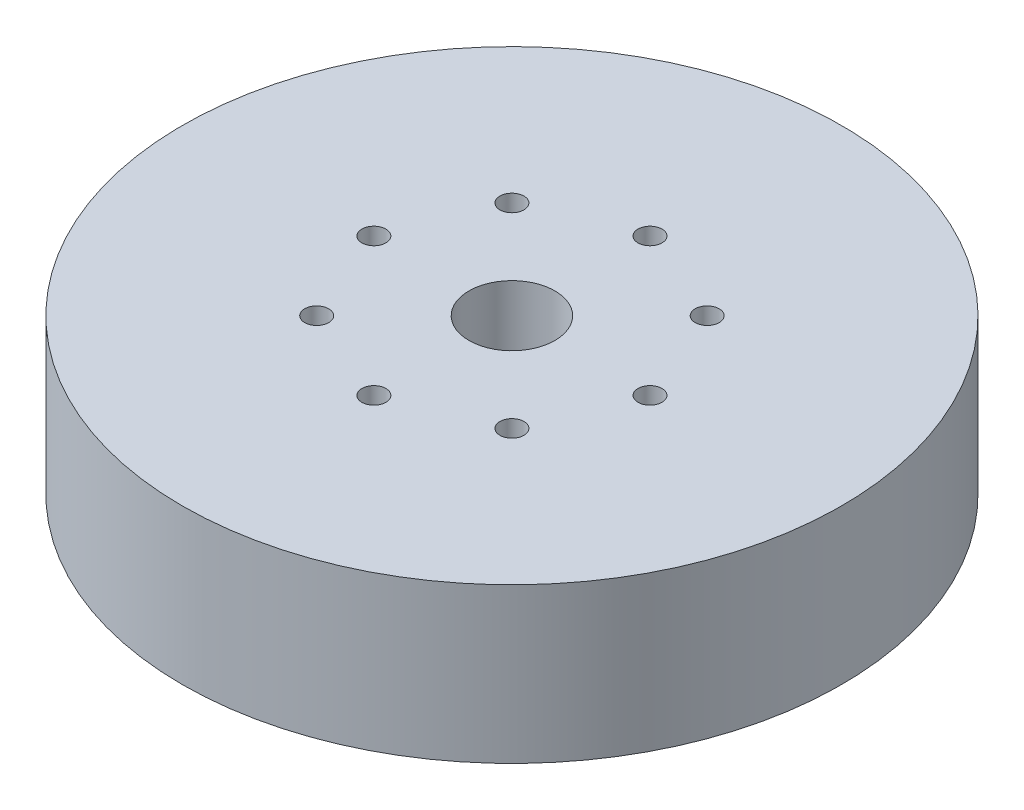
ISO-10303-21;
HEADER;
FILE_DESCRIPTION(('STEP AP214'),'2;1');
FILE_NAME('part.step','',(''),(''),'','','');
FILE_SCHEMA(('AUTOMOTIVE_DESIGN { 1 0 10303 214 1 1 1 1 }'));
ENDSEC;
DATA;
#1=APPLICATION_CONTEXT('core data for automotive mechanical design processes');
#2=APPLICATION_PROTOCOL_DEFINITION('international standard','automotive_design',2000,#1);
#3=PRODUCT_CONTEXT('',#1,'mechanical');
#4=PRODUCT('Part','Part','',(#3));
#5=PRODUCT_RELATED_PRODUCT_CATEGORY('part','',(#4));
#6=PRODUCT_DEFINITION_FORMATION('','',#4);
#7=PRODUCT_DEFINITION_CONTEXT('part definition',#1,'design');
#8=PRODUCT_DEFINITION('design','',#6,#7);
#9=PRODUCT_DEFINITION_SHAPE('','',#8);
#10=(LENGTH_UNIT() NAMED_UNIT(*) SI_UNIT(.MILLI.,.METRE.));
#11=(NAMED_UNIT(*) PLANE_ANGLE_UNIT() SI_UNIT($,.RADIAN.));
#12=(NAMED_UNIT(*) SI_UNIT($,.STERADIAN.) SOLID_ANGLE_UNIT());
#13=UNCERTAINTY_MEASURE_WITH_UNIT(LENGTH_MEASURE(1.E-05),#10,'distance_accuracy_value','');
#14=(GEOMETRIC_REPRESENTATION_CONTEXT(3) GLOBAL_UNCERTAINTY_ASSIGNED_CONTEXT((#13)) GLOBAL_UNIT_ASSIGNED_CONTEXT((#10,
#11,#12)) REPRESENTATION_CONTEXT('',''));
#15=CARTESIAN_POINT('',(0.,0.,0.));
#16=DIRECTION('',(0.,0.,1.));
#17=DIRECTION('',(1.,0.,0.));
#18=AXIS2_PLACEMENT_3D('',#15,#16,#17);
#19=CARTESIAN_POINT('',(0.,27.,0.));
#20=DIRECTION('',(0.,-1.,0.));
#21=DIRECTION('',(0.,0.,-1.));
#22=AXIS2_PLACEMENT_3D('',#19,#20,#21);
#23=CYLINDRICAL_SURFACE('',#22,57.5);
#24=CARTESIAN_POINT('',(0.,27.,0.));
#25=DIRECTION('',(0.,1.,0.));
#26=DIRECTION('',(0.,0.,1.));
#27=AXIS2_PLACEMENT_3D('',#24,#25,#26);
#28=CIRCLE('',#27,57.5);
#29=CARTESIAN_POINT('',(0.,27.,57.5));
#30=VERTEX_POINT('',#29);
#31=EDGE_CURVE('E10',#30,#30,#28,.T.);
#32=ORIENTED_EDGE('',*,*,#31,.F.);
#33=EDGE_LOOP('',(#32));
#34=FACE_BOUND('',#33,.T.);
#35=CARTESIAN_POINT('',(0.,0.,0.));
#36=DIRECTION('',(0.,1.,0.));
#37=DIRECTION('',(0.,0.,1.));
#38=AXIS2_PLACEMENT_3D('',#35,#36,#37);
#39=CIRCLE('',#38,57.5);
#40=CARTESIAN_POINT('',(0.,0.,57.5));
#41=VERTEX_POINT('',#40);
#42=EDGE_CURVE('E37',#41,#41,#39,.T.);
#43=ORIENTED_EDGE('',*,*,#42,.T.);
#44=EDGE_LOOP('',(#43));
#45=FACE_BOUND('',#44,.T.);
#46=ADVANCED_FACE('F40',(#34,#45),#23,.T.);
#47=CARTESIAN_POINT('',(0.,27.,0.));
#48=DIRECTION('',(0.,1.,0.));
#49=DIRECTION('',(0.,0.,1.));
#50=AXIS2_PLACEMENT_3D('',#47,#48,#49);
#51=PLANE('',#50);
#52=CARTESIAN_POINT('',(0.,27.,24.0871770834492));
#53=DIRECTION('',(0.,1.,0.));
#54=DIRECTION('',(1.,0.,0.));
#55=AXIS2_PLACEMENT_3D('',#52,#53,#54);
#56=CIRCLE('',#55,2.09508649983845);
#57=CARTESIAN_POINT('',(2.09508649983853,27.,24.0871770834491));
#58=VERTEX_POINT('',#57);
#59=EDGE_CURVE('E88',#58,#58,#56,.T.);
#60=ORIENTED_EDGE('',*,*,#59,.F.);
#61=EDGE_LOOP('',(#60));
#62=FACE_BOUND('',#61,.T.);
#63=CARTESIAN_POINT('',(17.0322062553482,27.,17.032206255348));
#64=DIRECTION('',(0.,1.,0.));
#65=DIRECTION('',(0.707106781186544,0.,-0.707106781186551));
#66=AXIS2_PLACEMENT_3D('',#63,#64,#65);
#67=CIRCLE('',#66,2.09508649983845);
#68=CARTESIAN_POINT('',(18.5136561265563,27.,15.5507563841399));
#69=VERTEX_POINT('',#68);
#70=EDGE_CURVE('E79',#69,#69,#67,.T.);
#71=ORIENTED_EDGE('',*,*,#70,.F.);
#72=EDGE_LOOP('',(#71));
#73=FACE_BOUND('',#72,.T.);
#74=CARTESIAN_POINT('',(24.0871770834492,27.,0.));
#75=DIRECTION('',(0.,1.,0.));
#76=DIRECTION('',(0.,0.,-1.));
#77=AXIS2_PLACEMENT_3D('',#74,#75,#76);
#78=CIRCLE('',#77,2.09508649983845);
#79=CARTESIAN_POINT('',(24.0871770834492,27.,-2.09508649983845));
#80=VERTEX_POINT('',#79);
#81=EDGE_CURVE('E74',#80,#80,#78,.T.);
#82=ORIENTED_EDGE('',*,*,#81,.F.);
#83=EDGE_LOOP('',(#82));
#84=FACE_BOUND('',#83,.T.);
#85=CARTESIAN_POINT('',(17.032206255348,27.,-17.0322062553482));
#86=DIRECTION('',(0.,1.,0.));
#87=DIRECTION('',(-0.707106781186554,0.,-0.707106781186541));
#88=AXIS2_PLACEMENT_3D('',#85,#86,#87);
#89=CIRCLE('',#88,2.09508649983845);
#90=CARTESIAN_POINT('',(15.5507563841398,27.,-18.5136561265564));
#91=VERTEX_POINT('',#90);
#92=EDGE_CURVE('E70',#91,#91,#89,.T.);
#93=ORIENTED_EDGE('',*,*,#92,.F.);
#94=EDGE_LOOP('',(#93));
#95=FACE_BOUND('',#94,.T.);
#96=CARTESIAN_POINT('',(-2.52299787876818E-13,27.,-24.0871770834492));
#97=DIRECTION('',(0.,1.,0.));
#98=DIRECTION('',(-1.,0.,0.));
#99=AXIS2_PLACEMENT_3D('',#96,#97,#98);
#100=CIRCLE('',#99,2.09508649983845);
#101=CARTESIAN_POINT('',(-2.0950864998387,27.,-24.0871770834491));
#102=VERTEX_POINT('',#101);
#103=EDGE_CURVE('E100',#102,#102,#100,.T.);
#104=ORIENTED_EDGE('',*,*,#103,.F.);
#105=EDGE_LOOP('',(#104));
#106=FACE_BOUND('',#105,.T.);
#107=CARTESIAN_POINT('',(-17.0322062553483,27.,-17.0322062553479));
#108=DIRECTION('',(0.,1.,0.));
#109=DIRECTION('',(-0.707106781186539,0.,0.707106781186556));
#110=AXIS2_PLACEMENT_3D('',#107,#108,#109);
#111=CIRCLE('',#110,2.09508649983845);
#112=CARTESIAN_POINT('',(-18.5136561265564,27.,-15.5507563841397));
#113=VERTEX_POINT('',#112);
#114=EDGE_CURVE('E93',#113,#113,#111,.T.);
#115=ORIENTED_EDGE('',*,*,#114,.F.);
#116=EDGE_LOOP('',(#115));
#117=FACE_BOUND('',#116,.T.);
#118=CARTESIAN_POINT('',(-17.0322062553481,27.,17.0322062553481));
#119=DIRECTION('',(0.,1.,0.));
#120=DIRECTION('',(0.707106781186549,0.,0.707106781186546));
#121=AXIS2_PLACEMENT_3D('',#118,#119,#120);
#122=CIRCLE('',#121,2.09508649983845);
#123=CARTESIAN_POINT('',(-15.5507563841399,27.,18.5136561265563));
#124=VERTEX_POINT('',#123);
#125=EDGE_CURVE('E61',#124,#124,#122,.T.);
#126=ORIENTED_EDGE('',*,*,#125,.F.);
#127=EDGE_LOOP('',(#126));
#128=FACE_BOUND('',#127,.T.);
#129=CARTESIAN_POINT('',(-24.0871770834492,27.,0.));
#130=DIRECTION('',(0.,1.,0.));
#131=DIRECTION('',(0.,0.,1.));
#132=AXIS2_PLACEMENT_3D('',#129,#130,#131);
#133=CIRCLE('',#132,2.09508649983845);
#134=CARTESIAN_POINT('',(-24.0871770834492,27.,2.09508649983845));
#135=VERTEX_POINT('',#134);
#136=EDGE_CURVE('E54',#135,#135,#133,.T.);
#137=ORIENTED_EDGE('',*,*,#136,.F.);
#138=EDGE_LOOP('',(#137));
#139=FACE_BOUND('',#138,.T.);
#140=CARTESIAN_POINT('',(0.,27.,0.));
#141=DIRECTION('',(0.,1.,0.));
#142=DIRECTION('',(0.,0.,1.));
#143=AXIS2_PLACEMENT_3D('',#140,#141,#142);
#144=CIRCLE('',#143,7.5);
#145=CARTESIAN_POINT('',(0.,27.,7.5));
#146=VERTEX_POINT('',#145);
#147=EDGE_CURVE('E50',#146,#146,#144,.T.);
#148=ORIENTED_EDGE('',*,*,#147,.F.);
#149=EDGE_LOOP('',(#148));
#150=FACE_BOUND('',#149,.T.);
#151=ORIENTED_EDGE('',*,*,#31,.T.);
#152=EDGE_LOOP('',(#151));
#153=FACE_BOUND('',#152,.T.);
#154=ADVANCED_FACE('F115',(#62,#73,#84,#95,#106,#117,#128,#139,#150,#153),#51,.T.);
#155=CARTESIAN_POINT('',(0.,0.,0.));
#156=DIRECTION('',(0.,1.,0.));
#157=DIRECTION('',(0.,0.,1.));
#158=AXIS2_PLACEMENT_3D('',#155,#156,#157);
#159=PLANE('',#158);
#160=CARTESIAN_POINT('',(0.,0.,0.));
#161=DIRECTION('',(0.,1.,0.));
#162=DIRECTION('',(0.,0.,1.));
#163=AXIS2_PLACEMENT_3D('',#160,#161,#162);
#164=CIRCLE('',#163,7.5);
#165=CARTESIAN_POINT('',(0.,0.,7.5));
#166=VERTEX_POINT('',#165);
#167=EDGE_CURVE('E47',#166,#166,#164,.T.);
#168=ORIENTED_EDGE('',*,*,#167,.T.);
#169=EDGE_LOOP('',(#168));
#170=FACE_BOUND('',#169,.T.);
#171=ORIENTED_EDGE('',*,*,#42,.F.);
#172=EDGE_LOOP('',(#171));
#173=FACE_BOUND('',#172,.T.);
#174=ADVANCED_FACE('F113',(#170,#173),#159,.F.);
#175=CARTESIAN_POINT('',(0.,27.,0.));
#176=DIRECTION('',(0.,-1.,0.));
#177=DIRECTION('',(0.,0.,-1.));
#178=AXIS2_PLACEMENT_3D('',#175,#176,#177);
#179=CYLINDRICAL_SURFACE('',#178,7.5);
#180=ORIENTED_EDGE('',*,*,#147,.T.);
#181=EDGE_LOOP('',(#180));
#182=FACE_BOUND('',#181,.T.);
#183=ORIENTED_EDGE('',*,*,#167,.F.);
#184=EDGE_LOOP('',(#183));
#185=FACE_BOUND('',#184,.T.);
#186=ADVANCED_FACE('F127',(#182,#185),#179,.F.);
#187=CARTESIAN_POINT('',(-24.0871770834492,5.52743065124902,0.));
#188=DIRECTION('',(0.,1.,0.));
#189=DIRECTION('',(0.,0.,1.));
#190=AXIS2_PLACEMENT_3D('',#187,#188,#189);
#191=CYLINDRICAL_SURFACE('',#190,2.09508649983845);
#192=CARTESIAN_POINT('',(-24.0871770834492,5.52743065124902,0.));
#193=DIRECTION('',(0.,1.,0.));
#194=DIRECTION('',(0.,0.,1.));
#195=AXIS2_PLACEMENT_3D('',#192,#193,#194);
#196=CIRCLE('',#195,2.09508649983845);
#197=CARTESIAN_POINT('',(-24.0871770834492,5.52743065124902,2.09508649983845));
#198=VERTEX_POINT('',#197);
#199=EDGE_CURVE('E55',#198,#198,#196,.T.);
#200=ORIENTED_EDGE('',*,*,#199,.F.);
#201=EDGE_LOOP('',(#200));
#202=FACE_BOUND('',#201,.T.);
#203=ORIENTED_EDGE('',*,*,#136,.T.);
#204=EDGE_LOOP('',(#203));
#205=FACE_BOUND('',#204,.T.);
#206=ADVANCED_FACE('F129',(#202,#205),#191,.F.);
#207=CARTESIAN_POINT('',(-24.0871770834492,5.52743065124902,0.));
#208=DIRECTION('',(0.,1.,0.));
#209=DIRECTION('',(0.,0.,1.));
#210=AXIS2_PLACEMENT_3D('',#207,#208,#209);
#211=PLANE('',#210);
#212=ORIENTED_EDGE('',*,*,#199,.T.);
#213=EDGE_LOOP('',(#212));
#214=FACE_BOUND('',#213,.T.);
#215=ADVANCED_FACE('F157',(#214),#211,.T.);
#216=CARTESIAN_POINT('',(-17.0322062553481,5.52743065124902,17.0322062553481));
#217=DIRECTION('',(0.,1.,0.));
#218=DIRECTION('',(0.,0.,1.));
#219=AXIS2_PLACEMENT_3D('',#216,#217,#218);
#220=CYLINDRICAL_SURFACE('',#219,2.09508649983845);
#221=CARTESIAN_POINT('',(-17.0322062553481,5.52743065124902,17.0322062553481));
#222=DIRECTION('',(0.,1.,0.));
#223=DIRECTION('',(0.707106781186549,0.,0.707106781186546));
#224=AXIS2_PLACEMENT_3D('',#221,#222,#223);
#225=CIRCLE('',#224,2.09508649983845);
#226=CARTESIAN_POINT('',(-15.5507563841399,5.52743065124902,18.5136561265563));
#227=VERTEX_POINT('',#226);
#228=EDGE_CURVE('E59',#227,#227,#225,.T.);
#229=ORIENTED_EDGE('',*,*,#228,.F.);
#230=EDGE_LOOP('',(#229));
#231=FACE_BOUND('',#230,.T.);
#232=ORIENTED_EDGE('',*,*,#125,.T.);
#233=EDGE_LOOP('',(#232));
#234=FACE_BOUND('',#233,.T.);
#235=ADVANCED_FACE('F170',(#231,#234),#220,.F.);
#236=CARTESIAN_POINT('',(-17.0322062553481,5.52743065124902,17.0322062553481));
#237=DIRECTION('',(0.,1.,0.));
#238=DIRECTION('',(0.707106781186549,0.,0.707106781186546));
#239=AXIS2_PLACEMENT_3D('',#236,#237,#238);
#240=PLANE('',#239);
#241=ORIENTED_EDGE('',*,*,#228,.T.);
#242=EDGE_LOOP('',(#241));
#243=FACE_BOUND('',#242,.T.);
#244=ADVANCED_FACE('F182',(#243),#240,.T.);
#245=CARTESIAN_POINT('',(-17.0322062553483,5.52743065124902,-17.0322062553479));
#246=DIRECTION('',(0.,1.,0.));
#247=DIRECTION('',(0.,0.,1.));
#248=AXIS2_PLACEMENT_3D('',#245,#246,#247);
#249=CYLINDRICAL_SURFACE('',#248,2.09508649983845);
#250=CARTESIAN_POINT('',(-17.0322062553483,5.52743065124902,-17.0322062553479));
#251=DIRECTION('',(0.,1.,0.));
#252=DIRECTION('',(-0.707106781186539,0.,0.707106781186556));
#253=AXIS2_PLACEMENT_3D('',#250,#251,#252);
#254=CIRCLE('',#253,2.09508649983845);
#255=CARTESIAN_POINT('',(-18.5136561265564,5.52743065124902,-15.5507563841397));
#256=VERTEX_POINT('',#255);
#257=EDGE_CURVE('E94',#256,#256,#254,.T.);
#258=ORIENTED_EDGE('',*,*,#257,.F.);
#259=EDGE_LOOP('',(#258));
#260=FACE_BOUND('',#259,.T.);
#261=ORIENTED_EDGE('',*,*,#114,.T.);
#262=EDGE_LOOP('',(#261));
#263=FACE_BOUND('',#262,.T.);
#264=ADVANCED_FACE('F189',(#260,#263),#249,.F.);
#265=CARTESIAN_POINT('',(-17.0322062553483,5.52743065124902,-17.0322062553479));
#266=DIRECTION('',(0.,1.,0.));
#267=DIRECTION('',(-0.707106781186539,0.,0.707106781186556));
#268=AXIS2_PLACEMENT_3D('',#265,#266,#267);
#269=PLANE('',#268);
#270=ORIENTED_EDGE('',*,*,#257,.T.);
#271=EDGE_LOOP('',(#270));
#272=FACE_BOUND('',#271,.T.);
#273=ADVANCED_FACE('F107',(#272),#269,.T.);
#274=CARTESIAN_POINT('',(-2.52299787876818E-13,5.52743065124902,-24.0871770834492));
#275=DIRECTION('',(0.,1.,0.));
#276=DIRECTION('',(0.,0.,1.));
#277=AXIS2_PLACEMENT_3D('',#274,#275,#276);
#278=CYLINDRICAL_SURFACE('',#277,2.09508649983845);
#279=CARTESIAN_POINT('',(-2.52299787876818E-13,5.52743065124902,-24.0871770834492));
#280=DIRECTION('',(0.,1.,0.));
#281=DIRECTION('',(-1.,0.,0.));
#282=AXIS2_PLACEMENT_3D('',#279,#280,#281);
#283=CIRCLE('',#282,2.09508649983845);
#284=CARTESIAN_POINT('',(-2.0950864998387,5.52743065124902,-24.0871770834491));
#285=VERTEX_POINT('',#284);
#286=EDGE_CURVE('E72',#285,#285,#283,.T.);
#287=ORIENTED_EDGE('',*,*,#286,.F.);
#288=EDGE_LOOP('',(#287));
#289=FACE_BOUND('',#288,.T.);
#290=ORIENTED_EDGE('',*,*,#103,.T.);
#291=EDGE_LOOP('',(#290));
#292=FACE_BOUND('',#291,.T.);
#293=ADVANCED_FACE('F104',(#289,#292),#278,.F.);
#294=CARTESIAN_POINT('',(-2.52299787876818E-13,5.52743065124902,-24.0871770834492));
#295=DIRECTION('',(0.,1.,0.));
#296=DIRECTION('',(-1.,0.,0.));
#297=AXIS2_PLACEMENT_3D('',#294,#295,#296);
#298=PLANE('',#297);
#299=ORIENTED_EDGE('',*,*,#286,.T.);
#300=EDGE_LOOP('',(#299));
#301=FACE_BOUND('',#300,.T.);
#302=ADVANCED_FACE('F103',(#301),#298,.T.);
#303=CARTESIAN_POINT('',(17.032206255348,5.52743065124902,-17.0322062553482));
#304=DIRECTION('',(0.,1.,0.));
#305=DIRECTION('',(0.,0.,1.));
#306=AXIS2_PLACEMENT_3D('',#303,#304,#305);
#307=CYLINDRICAL_SURFACE('',#306,2.09508649983845);
#308=CARTESIAN_POINT('',(17.032206255348,5.52743065124902,-17.0322062553482));
#309=DIRECTION('',(0.,1.,0.));
#310=DIRECTION('',(-0.707106781186554,0.,-0.707106781186541));
#311=AXIS2_PLACEMENT_3D('',#308,#309,#310);
#312=CIRCLE('',#311,2.09508649983845);
#313=CARTESIAN_POINT('',(15.5507563841398,5.52743065124902,-18.5136561265564));
#314=VERTEX_POINT('',#313);
#315=EDGE_CURVE('E69',#314,#314,#312,.T.);
#316=ORIENTED_EDGE('',*,*,#315,.F.);
#317=EDGE_LOOP('',(#316));
#318=FACE_BOUND('',#317,.T.);
#319=ORIENTED_EDGE('',*,*,#92,.T.);
#320=EDGE_LOOP('',(#319));
#321=FACE_BOUND('',#320,.T.);
#322=ADVANCED_FACE('F219',(#318,#321),#307,.F.);
#323=CARTESIAN_POINT('',(17.032206255348,5.52743065124902,-17.0322062553482));
#324=DIRECTION('',(0.,1.,0.));
#325=DIRECTION('',(-0.707106781186554,0.,-0.707106781186541));
#326=AXIS2_PLACEMENT_3D('',#323,#324,#325);
#327=PLANE('',#326);
#328=ORIENTED_EDGE('',*,*,#315,.T.);
#329=EDGE_LOOP('',(#328));
#330=FACE_BOUND('',#329,.T.);
#331=ADVANCED_FACE('F227',(#330),#327,.T.);
#332=CARTESIAN_POINT('',(24.0871770834492,5.52743065124902,0.));
#333=DIRECTION('',(0.,1.,0.));
#334=DIRECTION('',(0.,0.,1.));
#335=AXIS2_PLACEMENT_3D('',#332,#333,#334);
#336=CYLINDRICAL_SURFACE('',#335,2.09508649983845);
#337=CARTESIAN_POINT('',(24.0871770834492,5.52743065124902,0.));
#338=DIRECTION('',(0.,1.,0.));
#339=DIRECTION('',(0.,0.,-1.));
#340=AXIS2_PLACEMENT_3D('',#337,#338,#339);
#341=CIRCLE('',#340,2.09508649983845);
#342=CARTESIAN_POINT('',(24.0871770834492,5.52743065124902,-2.09508649983845));
#343=VERTEX_POINT('',#342);
#344=EDGE_CURVE('E80',#343,#343,#341,.T.);
#345=ORIENTED_EDGE('',*,*,#344,.F.);
#346=EDGE_LOOP('',(#345));
#347=FACE_BOUND('',#346,.T.);
#348=ORIENTED_EDGE('',*,*,#81,.T.);
#349=EDGE_LOOP('',(#348));
#350=FACE_BOUND('',#349,.T.);
#351=ADVANCED_FACE('F240',(#347,#350),#336,.F.);
#352=CARTESIAN_POINT('',(24.0871770834492,5.52743065124902,0.));
#353=DIRECTION('',(0.,1.,0.));
#354=DIRECTION('',(0.,0.,-1.));
#355=AXIS2_PLACEMENT_3D('',#352,#353,#354);
#356=PLANE('',#355);
#357=ORIENTED_EDGE('',*,*,#344,.T.);
#358=EDGE_LOOP('',(#357));
#359=FACE_BOUND('',#358,.T.);
#360=ADVANCED_FACE('F246',(#359),#356,.T.);
#361=CARTESIAN_POINT('',(17.0322062553482,5.52743065124902,17.032206255348));
#362=DIRECTION('',(0.,1.,0.));
#363=DIRECTION('',(0.,0.,1.));
#364=AXIS2_PLACEMENT_3D('',#361,#362,#363);
#365=CYLINDRICAL_SURFACE('',#364,2.09508649983845);
#366=CARTESIAN_POINT('',(17.0322062553482,5.52743065124902,17.032206255348));
#367=DIRECTION('',(0.,1.,0.));
#368=DIRECTION('',(0.707106781186544,0.,-0.707106781186551));
#369=AXIS2_PLACEMENT_3D('',#366,#367,#368);
#370=CIRCLE('',#369,2.09508649983845);
#371=CARTESIAN_POINT('',(18.5136561265563,5.52743065124902,15.5507563841399));
#372=VERTEX_POINT('',#371);
#373=EDGE_CURVE('E82',#372,#372,#370,.T.);
#374=ORIENTED_EDGE('',*,*,#373,.F.);
#375=EDGE_LOOP('',(#374));
#376=FACE_BOUND('',#375,.T.);
#377=ORIENTED_EDGE('',*,*,#70,.T.);
#378=EDGE_LOOP('',(#377));
#379=FACE_BOUND('',#378,.T.);
#380=ADVANCED_FACE('F254',(#376,#379),#365,.F.);
#381=CARTESIAN_POINT('',(17.0322062553482,5.52743065124902,17.032206255348));
#382=DIRECTION('',(0.,1.,0.));
#383=DIRECTION('',(0.707106781186544,0.,-0.707106781186551));
#384=AXIS2_PLACEMENT_3D('',#381,#382,#383);
#385=PLANE('',#384);
#386=ORIENTED_EDGE('',*,*,#373,.T.);
#387=EDGE_LOOP('',(#386));
#388=FACE_BOUND('',#387,.T.);
#389=ADVANCED_FACE('F262',(#388),#385,.T.);
#390=CARTESIAN_POINT('',(0.,5.52743065124902,24.0871770834492));
#391=DIRECTION('',(0.,1.,0.));
#392=DIRECTION('',(0.,0.,1.));
#393=AXIS2_PLACEMENT_3D('',#390,#391,#392);
#394=CYLINDRICAL_SURFACE('',#393,2.09508649983845);
#395=CARTESIAN_POINT('',(0.,5.52743065124902,24.0871770834492));
#396=DIRECTION('',(0.,1.,0.));
#397=DIRECTION('',(1.,0.,0.));
#398=AXIS2_PLACEMENT_3D('',#395,#396,#397);
#399=CIRCLE('',#398,2.09508649983845);
#400=CARTESIAN_POINT('',(2.09508649983853,5.52743065124902,24.0871770834491));
#401=VERTEX_POINT('',#400);
#402=EDGE_CURVE('E63',#401,#401,#399,.T.);
#403=ORIENTED_EDGE('',*,*,#402,.F.);
#404=EDGE_LOOP('',(#403));
#405=FACE_BOUND('',#404,.T.);
#406=ORIENTED_EDGE('',*,*,#59,.T.);
#407=EDGE_LOOP('',(#406));
#408=FACE_BOUND('',#407,.T.);
#409=ADVANCED_FACE('F272',(#405,#408),#394,.F.);
#410=CARTESIAN_POINT('',(0.,5.52743065124902,24.0871770834492));
#411=DIRECTION('',(0.,1.,0.));
#412=DIRECTION('',(1.,0.,0.));
#413=AXIS2_PLACEMENT_3D('',#410,#411,#412);
#414=PLANE('',#413);
#415=ORIENTED_EDGE('',*,*,#402,.T.);
#416=EDGE_LOOP('',(#415));
#417=FACE_BOUND('',#416,.T.);
#418=ADVANCED_FACE('F285',(#417),#414,.T.);
#419=CLOSED_SHELL('',(#46,#154,#174,#186,#206,#215,#235,#244,#264,#273,#293,#302,#322,#331,#351,
#360,#380,#389,#409,#418));
#420=MANIFOLD_SOLID_BREP('B2',#419);
#421=ADVANCED_BREP_SHAPE_REPRESENTATION('',(#18,#420),#14);
#422=SHAPE_DEFINITION_REPRESENTATION(#9,#421);
ENDSEC;
END-ISO-10303-21;
